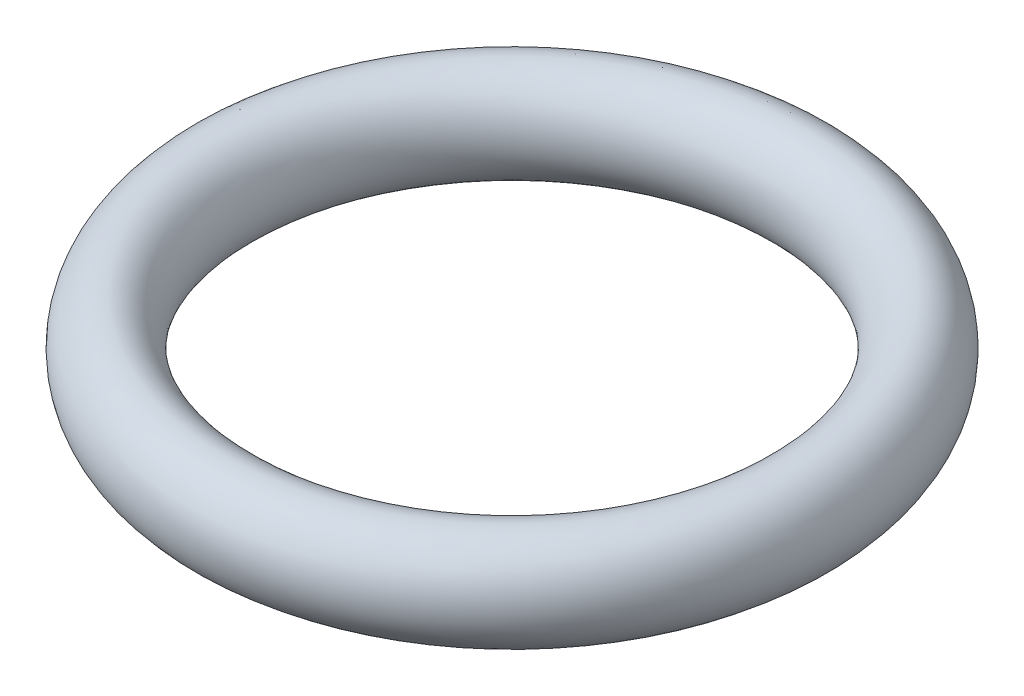
ISO-10303-21;
HEADER;
FILE_DESCRIPTION(('STEP AP214'),'2;1');
FILE_NAME('part.step','',(''),(''),'','','');
FILE_SCHEMA(('AUTOMOTIVE_DESIGN { 1 0 10303 214 1 1 1 1 }'));
ENDSEC;
DATA;
#1=APPLICATION_CONTEXT('core data for automotive mechanical design processes');
#2=APPLICATION_PROTOCOL_DEFINITION('international standard','automotive_design',2000,#1);
#3=PRODUCT_CONTEXT('',#1,'mechanical');
#4=PRODUCT('Part','Part','',(#3));
#5=PRODUCT_RELATED_PRODUCT_CATEGORY('part','',(#4));
#6=PRODUCT_DEFINITION_FORMATION('','',#4);
#7=PRODUCT_DEFINITION_CONTEXT('part definition',#1,'design');
#8=PRODUCT_DEFINITION('design','',#6,#7);
#9=PRODUCT_DEFINITION_SHAPE('','',#8);
#10=(LENGTH_UNIT() NAMED_UNIT(*) SI_UNIT(.MILLI.,.METRE.));
#11=(NAMED_UNIT(*) PLANE_ANGLE_UNIT() SI_UNIT($,.RADIAN.));
#12=(NAMED_UNIT(*) SI_UNIT($,.STERADIAN.) SOLID_ANGLE_UNIT());
#13=UNCERTAINTY_MEASURE_WITH_UNIT(LENGTH_MEASURE(1.E-05),#10,'distance_accuracy_value','');
#14=(GEOMETRIC_REPRESENTATION_CONTEXT(3) GLOBAL_UNCERTAINTY_ASSIGNED_CONTEXT((#13)) GLOBAL_UNIT_ASSIGNED_CONTEXT((#10,
#11,#12)) REPRESENTATION_CONTEXT('',''));
#15=CARTESIAN_POINT('',(0.,0.,0.));
#16=DIRECTION('',(0.,0.,1.));
#17=DIRECTION('',(1.,0.,0.));
#18=AXIS2_PLACEMENT_3D('',#15,#16,#17);
#19=CARTESIAN_POINT('',(-5.79515,0.,0.));
#20=DIRECTION('',(0.,0.,1.));
#21=DIRECTION('',(0.,1.,0.));
#22=AXIS2_PLACEMENT_3D('',#19,#20,#21);
#23=ELLIPSE('',#22,1.,0.85485);
#24=CARTESIAN_POINT('',(0.,1.,0.));
#25=DIRECTION('',(0.,1.,0.));
#26=AXIS1_PLACEMENT('',#24,#25);
#27=SURFACE_OF_REVOLUTION('',#23,#26);
#28=ADVANCED_FACE('F29',(),#27,.F.);
#29=CLOSED_SHELL('',(#28));
#30=MANIFOLD_SOLID_BREP('B2',#29);
#31=ADVANCED_BREP_SHAPE_REPRESENTATION('',(#18,#30),#14);
#32=SHAPE_DEFINITION_REPRESENTATION(#9,#31);
ENDSEC;
END-ISO-10303-21;
